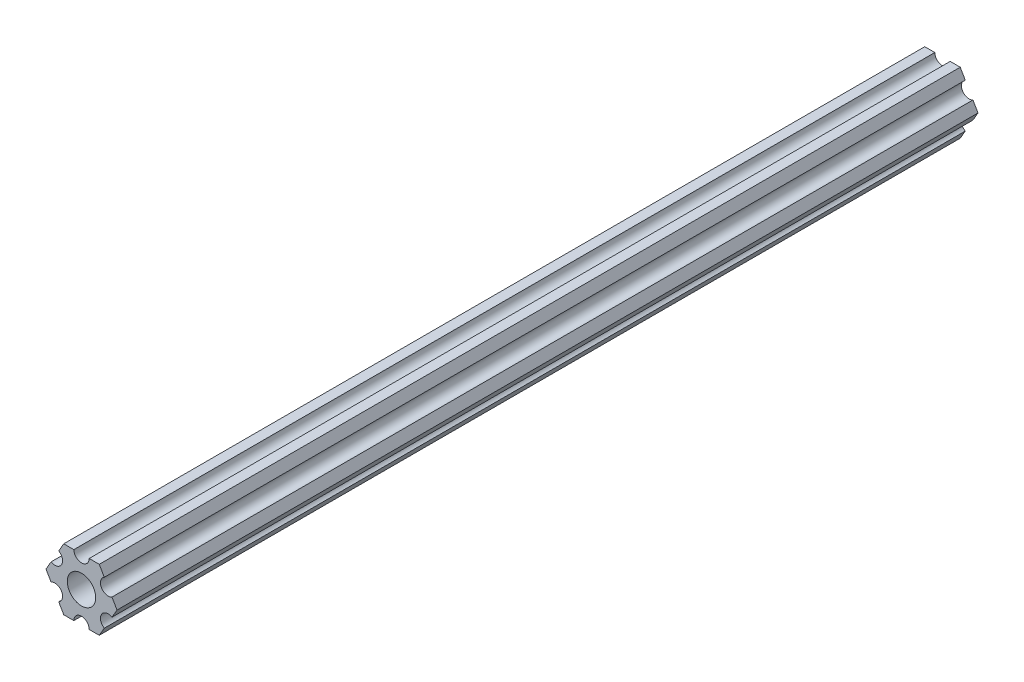
ISO-10303-21;
HEADER;
FILE_DESCRIPTION(('STEP AP214'),'2;1');
FILE_NAME('part.step','',(''),(''),'','','');
FILE_SCHEMA(('AUTOMOTIVE_DESIGN { 1 0 10303 214 1 1 1 1 }'));
ENDSEC;
DATA;
#1=APPLICATION_CONTEXT('core data for automotive mechanical design processes');
#2=APPLICATION_PROTOCOL_DEFINITION('international standard','automotive_design',2000,#1);
#3=PRODUCT_CONTEXT('',#1,'mechanical');
#4=PRODUCT('Part','Part','',(#3));
#5=PRODUCT_RELATED_PRODUCT_CATEGORY('part','',(#4));
#6=PRODUCT_DEFINITION_FORMATION('','',#4);
#7=PRODUCT_DEFINITION_CONTEXT('part definition',#1,'design');
#8=PRODUCT_DEFINITION('design','',#6,#7);
#9=PRODUCT_DEFINITION_SHAPE('','',#8);
#10=(LENGTH_UNIT() NAMED_UNIT(*) SI_UNIT(.MILLI.,.METRE.));
#11=(NAMED_UNIT(*) PLANE_ANGLE_UNIT() SI_UNIT($,.RADIAN.));
#12=(NAMED_UNIT(*) SI_UNIT($,.STERADIAN.) SOLID_ANGLE_UNIT());
#13=UNCERTAINTY_MEASURE_WITH_UNIT(LENGTH_MEASURE(1.E-05),#10,'distance_accuracy_value','');
#14=(GEOMETRIC_REPRESENTATION_CONTEXT(3) GLOBAL_UNCERTAINTY_ASSIGNED_CONTEXT((#13)) GLOBAL_UNIT_ASSIGNED_CONTEXT((#10,
#11,#12)) REPRESENTATION_CONTEXT('',''));
#15=CARTESIAN_POINT('',(0.,0.,0.));
#16=DIRECTION('',(0.,0.,1.));
#17=DIRECTION('',(1.,0.,0.));
#18=AXIS2_PLACEMENT_3D('',#15,#16,#17);
#19=CARTESIAN_POINT('',(0.,0.,-12.7));
#20=DIRECTION('',(0.,0.,-1.));
#21=DIRECTION('',(0.,-1.,0.));
#22=AXIS2_PLACEMENT_3D('',#19,#20,#21);
#23=PLANE('',#22);
#24=CARTESIAN_POINT('',(158.928629669335,29.0087650860692,-12.7));
#25=DIRECTION('',(0.,0.,-1.));
#26=DIRECTION('',(-1.,0.,0.));
#27=AXIS2_PLACEMENT_3D('',#24,#25,#26);
#28=CIRCLE('',#27,2.9337);
#29=CARTESIAN_POINT('',(155.994929669335,29.0087650860692,-12.7));
#30=VERTEX_POINT('',#29);
#31=EDGE_CURVE('E402',#30,#30,#28,.T.);
#32=ORIENTED_EDGE('',*,*,#31,.T.);
#33=EDGE_LOOP('',(#32));
#34=FACE_BOUND('',#33,.T.);
#35=DIRECTION('',(0.499999947533935,0.866025434075734,0.));
#36=VECTOR('',#35,1.);
#37=CARTESIAN_POINT('',(162.594804263388,22.6587653081755,-12.7));
#38=LINE('',#37,#36);
#39=CARTESIAN_POINT('',(162.594804263388,22.6587653081755,-12.7));
#40=VERTEX_POINT('',#39);
#41=CARTESIAN_POINT('',(163.634141259006,24.4589500426334,-12.7));
#42=VERTEX_POINT('',#41);
#43=EDGE_CURVE('E11',#40,#42,#38,.T.);
#44=ORIENTED_EDGE('',*,*,#43,.T.);
#45=CARTESIAN_POINT('',(164.427891175716,25.8337654192285,-12.7));
#46=DIRECTION('',(0.,0.,-1.));
#47=DIRECTION('',(-1.,0.,0.));
#48=AXIS2_PLACEMENT_3D('',#45,#46,#47);
#49=CIRCLE('',#48,1.5875);
#50=CARTESIAN_POINT('',(165.221641092426,27.2085807958237,-12.7));
#51=VERTEX_POINT('',#50);
#52=EDGE_CURVE('E37',#42,#51,#49,.T.);
#53=ORIENTED_EDGE('',*,*,#52,.T.);
#54=DIRECTION('',(0.499999947533942,0.86602543407573,0.));
#55=VECTOR('',#54,1.);
#56=CARTESIAN_POINT('',(165.221641092426,27.2085807958237,-12.7));
#57=LINE('',#56,#55);
#58=CARTESIAN_POINT('',(166.260978088043,29.0087655302817,-12.7));
#59=VERTEX_POINT('',#58);
#60=EDGE_CURVE('E196',#51,#59,#57,.T.);
#61=ORIENTED_EDGE('',*,*,#60,.T.);
#62=DIRECTION('',(-0.500000052466056,0.866025373493145,0.));
#63=VECTOR('',#62,1.);
#64=CARTESIAN_POINT('',(166.260978088043,29.0087655302817,-12.7));
#65=LINE('',#64,#63);
#66=CARTESIAN_POINT('',(165.221640874306,30.8089501388082,-12.7));
#67=VERTEX_POINT('',#66);
#68=EDGE_CURVE('E215',#59,#67,#65,.T.);
#69=ORIENTED_EDGE('',*,*,#68,.T.);
#70=CARTESIAN_POINT('',(164.427890791016,32.1837654192285,-12.7));
#71=DIRECTION('',(0.,0.,-1.));
#72=DIRECTION('',(-1.,0.,0.));
#73=AXIS2_PLACEMENT_3D('',#70,#71,#72);
#74=CIRCLE('',#73,1.5875);
#75=CARTESIAN_POINT('',(163.634140707727,33.5585806996489,-12.7));
#76=VERTEX_POINT('',#75);
#77=EDGE_CURVE('E417',#67,#76,#74,.T.);
#78=ORIENTED_EDGE('',*,*,#77,.T.);
#79=DIRECTION('',(-0.500000052466048,0.86602537349315,0.));
#80=VECTOR('',#79,1.);
#81=CARTESIAN_POINT('',(163.634140707727,33.5585806996489,-12.7));
#82=LINE('',#81,#80);
#83=CARTESIAN_POINT('',(162.59480349399,35.3587653081754,-12.7));
#84=VERTEX_POINT('',#83);
#85=EDGE_CURVE('E153',#76,#84,#82,.T.);
#86=ORIENTED_EDGE('',*,*,#85,.T.);
#87=DIRECTION('',(-1.,-6.05825863129189E-08,0.));
#88=VECTOR('',#87,1.);
#89=CARTESIAN_POINT('',(162.59480349399,35.3587653081754,-12.7));
#90=LINE('',#89,#88);
#91=CARTESIAN_POINT('',(160.516129284635,35.358765182244,-12.7));
#92=VERTEX_POINT('',#91);
#93=EDGE_CURVE('E155',#84,#92,#90,.T.);
#94=ORIENTED_EDGE('',*,*,#93,.T.);
#95=CARTESIAN_POINT('',(158.928629284635,35.3587650860692,-12.7));
#96=DIRECTION('',(0.,0.,-1.));
#97=DIRECTION('',(-1.,0.,0.));
#98=AXIS2_PLACEMENT_3D('',#95,#96,#97);
#99=CIRCLE('',#98,1.5875);
#100=CARTESIAN_POINT('',(157.341129284636,35.3587650860692,-12.7));
#101=VERTEX_POINT('',#100);
#102=EDGE_CURVE('E232',#92,#101,#99,.T.);
#103=ORIENTED_EDGE('',*,*,#102,.T.);
#104=DIRECTION('',(-1.,-6.05825963273181E-08,0.));
#105=VECTOR('',#104,1.);
#106=CARTESIAN_POINT('',(157.341129284636,35.3587649898944,-12.7));
#107=LINE('',#106,#105);
#108=CARTESIAN_POINT('',(155.262455075281,35.3587648639629,-12.7));
#109=VERTEX_POINT('',#108);
#110=EDGE_CURVE('E237',#101,#109,#107,.T.);
#111=ORIENTED_EDGE('',*,*,#110,.T.);
#112=DIRECTION('',(-0.499999947533936,-0.866025434075733,0.));
#113=VECTOR('',#112,1.);
#114=CARTESIAN_POINT('',(155.262455075281,35.3587648639629,-12.7));
#115=LINE('',#114,#113);
#116=CARTESIAN_POINT('',(154.223118079664,33.5585801295051,-12.7));
#117=VERTEX_POINT('',#116);
#118=EDGE_CURVE('E250',#109,#117,#115,.T.);
#119=ORIENTED_EDGE('',*,*,#118,.T.);
#120=CARTESIAN_POINT('',(153.429368162954,32.1837647529099,-12.7));
#121=DIRECTION('',(0.,0.,-1.));
#122=DIRECTION('',(-1.,0.,0.));
#123=AXIS2_PLACEMENT_3D('',#120,#121,#122);
#124=CIRCLE('',#123,1.5875);
#125=CARTESIAN_POINT('',(152.635618246244,30.8089493763146,-12.7));
#126=VERTEX_POINT('',#125);
#127=EDGE_CURVE('E187',#117,#126,#124,.T.);
#128=ORIENTED_EDGE('',*,*,#127,.T.);
#129=DIRECTION('',(-0.499999947533944,-0.866025434075728,0.));
#130=VECTOR('',#129,1.);
#131=CARTESIAN_POINT('',(152.635618246244,30.8089493763146,-12.7));
#132=LINE('',#131,#130);
#133=CARTESIAN_POINT('',(151.596281250627,29.0087646418567,-12.7));
#134=VERTEX_POINT('',#133);
#135=EDGE_CURVE('E260',#126,#134,#132,.T.);
#136=ORIENTED_EDGE('',*,*,#135,.T.);
#137=DIRECTION('',(0.50000005246604,-0.866025373493155,0.));
#138=VECTOR('',#137,1.);
#139=CARTESIAN_POINT('',(151.596281250627,29.0087646418567,-12.7));
#140=LINE('',#139,#138);
#141=CARTESIAN_POINT('',(152.635618464363,27.2085800333302,-12.7));
#142=VERTEX_POINT('',#141);
#143=EDGE_CURVE('E264',#134,#142,#140,.T.);
#144=ORIENTED_EDGE('',*,*,#143,.T.);
#145=CARTESIAN_POINT('',(153.429368547653,25.8337647529099,-12.7));
#146=DIRECTION('',(0.,0.,-1.));
#147=DIRECTION('',(-1.,0.,0.));
#148=AXIS2_PLACEMENT_3D('',#145,#146,#147);
#149=CIRCLE('',#148,1.5875);
#150=CARTESIAN_POINT('',(154.223118630943,24.4589494724895,-12.7));
#151=VERTEX_POINT('',#150);
#152=EDGE_CURVE('E219',#142,#151,#149,.T.);
#153=ORIENTED_EDGE('',*,*,#152,.T.);
#154=DIRECTION('',(0.500000052466047,-0.866025373493151,0.));
#155=VECTOR('',#154,1.);
#156=CARTESIAN_POINT('',(154.223118630943,24.4589494724895,-12.7));
#157=LINE('',#156,#155);
#158=CARTESIAN_POINT('',(155.26245584468,22.658764863963,-12.7));
#159=VERTEX_POINT('',#158);
#160=EDGE_CURVE('E157',#151,#159,#157,.T.);
#161=ORIENTED_EDGE('',*,*,#160,.T.);
#162=DIRECTION('',(1.,6.05825863129189E-08,0.));
#163=VECTOR('',#162,1.);
#164=CARTESIAN_POINT('',(155.26245584468,22.658764863963,-12.7));
#165=LINE('',#164,#163);
#166=CARTESIAN_POINT('',(157.341130054034,22.6587649898944,-12.7));
#167=VERTEX_POINT('',#166);
#168=EDGE_CURVE('E91',#159,#167,#165,.T.);
#169=ORIENTED_EDGE('',*,*,#168,.T.);
#170=CARTESIAN_POINT('',(158.928630054034,22.6587650860692,-12.7));
#171=DIRECTION('',(0.,0.,-1.));
#172=DIRECTION('',(-1.,0.,0.));
#173=AXIS2_PLACEMENT_3D('',#170,#171,#172);
#174=CIRCLE('',#173,1.5875);
#175=CARTESIAN_POINT('',(160.516130054034,22.658765182244,-12.7));
#176=VERTEX_POINT('',#175);
#177=EDGE_CURVE('E93',#167,#176,#174,.T.);
#178=ORIENTED_EDGE('',*,*,#177,.T.);
#179=DIRECTION('',(1.,6.05825712913108E-08,0.));
#180=VECTOR('',#179,1.);
#181=CARTESIAN_POINT('',(160.516130054034,22.658765182244,-12.7));
#182=LINE('',#181,#180);
#183=EDGE_CURVE('E77',#176,#40,#182,.T.);
#184=ORIENTED_EDGE('',*,*,#183,.T.);
#185=EDGE_LOOP('',(#44,#53,#61,#69,#78,#86,#94,#103,#111,#119,#128,#136,#144,#153,#161,#169,
#178,#184));
#186=FACE_BOUND('',#185,.T.);
#187=ADVANCED_FACE('F17',(#34,#186),#23,.F.);
#188=CARTESIAN_POINT('',(162.594804263388,22.6587653081755,0.));
#189=DIRECTION('',(-0.86602543407573,0.499999947533941,0.));
#190=DIRECTION('',(0.,0.,1.));
#191=AXIS2_PLACEMENT_3D('',#188,#189,#190);
#192=PLANE('',#191);
#193=DIRECTION('',(0.,0.,-1.));
#194=VECTOR('',#193,1.);
#195=CARTESIAN_POINT('',(163.634141259006,24.4589500426334,0.));
#196=LINE('',#195,#194);
#197=CARTESIAN_POINT('',(163.634141259006,24.4589500426334,-190.5));
#198=VERTEX_POINT('',#197);
#199=EDGE_CURVE('E20',#42,#198,#196,.T.);
#200=ORIENTED_EDGE('',*,*,#199,.F.);
#201=ORIENTED_EDGE('',*,*,#43,.F.);
#202=DIRECTION('',(0.,0.,-1.));
#203=VECTOR('',#202,1.);
#204=CARTESIAN_POINT('',(162.594804263388,22.6587653081755,0.));
#205=LINE('',#204,#203);
#206=CARTESIAN_POINT('',(162.594804263388,22.6587653081755,-190.5));
#207=VERTEX_POINT('',#206);
#208=EDGE_CURVE('E87',#40,#207,#205,.T.);
#209=ORIENTED_EDGE('',*,*,#208,.T.);
#210=DIRECTION('',(0.499999947533941,0.86602543407573,0.));
#211=VECTOR('',#210,1.);
#212=CARTESIAN_POINT('',(162.594804263388,22.6587653081755,-190.5));
#213=LINE('',#212,#211);
#214=EDGE_CURVE('E123',#207,#198,#213,.T.);
#215=ORIENTED_EDGE('',*,*,#214,.T.);
#216=EDGE_LOOP('',(#200,#201,#209,#215));
#217=FACE_BOUND('',#216,.T.);
#218=ADVANCED_FACE('F120',(#217),#192,.F.);
#219=CARTESIAN_POINT('',(160.516130054034,22.658765182244,0.));
#220=DIRECTION('',(-6.05825721258438E-08,1.,0.));
#221=DIRECTION('',(0.,0.,1.));
#222=AXIS2_PLACEMENT_3D('',#219,#220,#221);
#223=PLANE('',#222);
#224=ORIENTED_EDGE('',*,*,#208,.F.);
#225=ORIENTED_EDGE('',*,*,#183,.F.);
#226=DIRECTION('',(0.,0.,-1.));
#227=VECTOR('',#226,1.);
#228=CARTESIAN_POINT('',(160.516130054034,22.658765182244,0.));
#229=LINE('',#228,#227);
#230=CARTESIAN_POINT('',(160.516130054034,22.658765182244,-190.5));
#231=VERTEX_POINT('',#230);
#232=EDGE_CURVE('E82',#176,#231,#229,.T.);
#233=ORIENTED_EDGE('',*,*,#232,.T.);
#234=DIRECTION('',(1.,6.05825721258438E-08,0.));
#235=VECTOR('',#234,1.);
#236=CARTESIAN_POINT('',(160.516130054034,22.658765182244,-190.5));
#237=LINE('',#236,#235);
#238=EDGE_CURVE('E130',#231,#207,#237,.T.);
#239=ORIENTED_EDGE('',*,*,#238,.T.);
#240=EDGE_LOOP('',(#224,#225,#233,#239));
#241=FACE_BOUND('',#240,.T.);
#242=ADVANCED_FACE('F79',(#241),#223,.F.);
#243=CARTESIAN_POINT('',(158.928630054034,22.6587650860692,0.));
#244=DIRECTION('',(0.,0.,-1.));
#245=DIRECTION('',(-1.,0.,0.));
#246=AXIS2_PLACEMENT_3D('',#243,#244,#245);
#247=CYLINDRICAL_SURFACE('',#246,1.5875);
#248=ORIENTED_EDGE('',*,*,#232,.F.);
#249=ORIENTED_EDGE('',*,*,#177,.F.);
#250=DIRECTION('',(0.,0.,-1.));
#251=VECTOR('',#250,1.);
#252=CARTESIAN_POINT('',(157.341130054034,22.6587649898944,0.));
#253=LINE('',#252,#251);
#254=CARTESIAN_POINT('',(157.341130054034,22.6587649898944,-190.5));
#255=VERTEX_POINT('',#254);
#256=EDGE_CURVE('E108',#167,#255,#253,.T.);
#257=ORIENTED_EDGE('',*,*,#256,.T.);
#258=CARTESIAN_POINT('',(158.928630054034,22.6587650860692,-190.5));
#259=DIRECTION('',(0.,0.,-1.));
#260=DIRECTION('',(1.,0.,0.));
#261=AXIS2_PLACEMENT_3D('',#258,#259,#260);
#262=CIRCLE('',#261,1.5875);
#263=EDGE_CURVE('E101',#255,#231,#262,.T.);
#264=ORIENTED_EDGE('',*,*,#263,.T.);
#265=EDGE_LOOP('',(#248,#249,#257,#264));
#266=FACE_BOUND('',#265,.T.);
#267=ADVANCED_FACE('F97',(#266),#247,.F.);
#268=CARTESIAN_POINT('',(155.26245584468,22.658764863963,0.));
#269=DIRECTION('',(-6.05825854783851E-08,1.,0.));
#270=DIRECTION('',(0.,0.,1.));
#271=AXIS2_PLACEMENT_3D('',#268,#269,#270);
#272=PLANE('',#271);
#273=ORIENTED_EDGE('',*,*,#256,.F.);
#274=ORIENTED_EDGE('',*,*,#168,.F.);
#275=DIRECTION('',(0.,0.,-1.));
#276=VECTOR('',#275,1.);
#277=CARTESIAN_POINT('',(155.26245584468,22.658764863963,0.));
#278=LINE('',#277,#276);
#279=CARTESIAN_POINT('',(155.26245584468,22.658764863963,-190.5));
#280=VERTEX_POINT('',#279);
#281=EDGE_CURVE('E167',#159,#280,#278,.T.);
#282=ORIENTED_EDGE('',*,*,#281,.T.);
#283=DIRECTION('',(1.,6.05825854783851E-08,0.));
#284=VECTOR('',#283,1.);
#285=CARTESIAN_POINT('',(155.26245584468,22.658764863963,-190.5));
#286=LINE('',#285,#284);
#287=EDGE_CURVE('E156',#280,#255,#286,.T.);
#288=ORIENTED_EDGE('',*,*,#287,.T.);
#289=EDGE_LOOP('',(#273,#274,#282,#288));
#290=FACE_BOUND('',#289,.T.);
#291=ADVANCED_FACE('F465',(#290),#272,.F.);
#292=CARTESIAN_POINT('',(154.223118630943,24.4589494724895,0.));
#293=DIRECTION('',(0.866025373493152,0.500000052466045,0.));
#294=DIRECTION('',(0.,0.,-1.));
#295=AXIS2_PLACEMENT_3D('',#292,#293,#294);
#296=PLANE('',#295);
#297=ORIENTED_EDGE('',*,*,#281,.F.);
#298=ORIENTED_EDGE('',*,*,#160,.F.);
#299=DIRECTION('',(0.,0.,-1.));
#300=VECTOR('',#299,1.);
#301=CARTESIAN_POINT('',(154.223118630943,24.4589494724895,0.));
#302=LINE('',#301,#300);
#303=CARTESIAN_POINT('',(154.223118630943,24.4589494724895,-190.5));
#304=VERTEX_POINT('',#303);
#305=EDGE_CURVE('E267',#151,#304,#302,.T.);
#306=ORIENTED_EDGE('',*,*,#305,.T.);
#307=DIRECTION('',(0.500000052466045,-0.866025373493152,0.));
#308=VECTOR('',#307,1.);
#309=CARTESIAN_POINT('',(154.223118630943,24.4589494724895,-190.5));
#310=LINE('',#309,#308);
#311=EDGE_CURVE('E162',#304,#280,#310,.T.);
#312=ORIENTED_EDGE('',*,*,#311,.T.);
#313=EDGE_LOOP('',(#297,#298,#306,#312));
#314=FACE_BOUND('',#313,.T.);
#315=ADVANCED_FACE('F286',(#314),#296,.F.);
#316=CARTESIAN_POINT('',(153.429368547653,25.8337647529099,0.));
#317=DIRECTION('',(0.,0.,-1.));
#318=DIRECTION('',(-1.,0.,0.));
#319=AXIS2_PLACEMENT_3D('',#316,#317,#318);
#320=CYLINDRICAL_SURFACE('',#319,1.5875);
#321=ORIENTED_EDGE('',*,*,#305,.F.);
#322=ORIENTED_EDGE('',*,*,#152,.F.);
#323=DIRECTION('',(0.,0.,-1.));
#324=VECTOR('',#323,1.);
#325=CARTESIAN_POINT('',(152.635618464363,27.2085800333302,0.));
#326=LINE('',#325,#324);
#327=CARTESIAN_POINT('',(152.635618464363,27.2085800333302,-190.5));
#328=VERTEX_POINT('',#327);
#329=EDGE_CURVE('E261',#142,#328,#326,.T.);
#330=ORIENTED_EDGE('',*,*,#329,.T.);
#331=CARTESIAN_POINT('',(153.429368547653,25.8337647529099,-190.5));
#332=DIRECTION('',(0.,0.,-1.));
#333=DIRECTION('',(1.,0.,0.));
#334=AXIS2_PLACEMENT_3D('',#331,#332,#333);
#335=CIRCLE('',#334,1.5875);
#336=EDGE_CURVE('E170',#328,#304,#335,.T.);
#337=ORIENTED_EDGE('',*,*,#336,.T.);
#338=EDGE_LOOP('',(#321,#322,#330,#337));
#339=FACE_BOUND('',#338,.T.);
#340=ADVANCED_FACE('F278',(#339),#320,.F.);
#341=CARTESIAN_POINT('',(151.596281250627,29.0087646418567,0.));
#342=DIRECTION('',(0.866025373493151,0.500000052466045,0.));
#343=DIRECTION('',(0.,0.,-1.));
#344=AXIS2_PLACEMENT_3D('',#341,#342,#343);
#345=PLANE('',#344);
#346=ORIENTED_EDGE('',*,*,#329,.F.);
#347=ORIENTED_EDGE('',*,*,#143,.F.);
#348=DIRECTION('',(0.,0.,-1.));
#349=VECTOR('',#348,1.);
#350=CARTESIAN_POINT('',(151.596281250627,29.0087646418567,0.));
#351=LINE('',#350,#349);
#352=CARTESIAN_POINT('',(151.596281250627,29.0087646418567,-190.5));
#353=VERTEX_POINT('',#352);
#354=EDGE_CURVE('E195',#134,#353,#351,.T.);
#355=ORIENTED_EDGE('',*,*,#354,.T.);
#356=DIRECTION('',(0.500000052466045,-0.866025373493151,0.));
#357=VECTOR('',#356,1.);
#358=CARTESIAN_POINT('',(151.596281250627,29.0087646418567,-190.5));
#359=LINE('',#358,#357);
#360=EDGE_CURVE('E171',#353,#328,#359,.T.);
#361=ORIENTED_EDGE('',*,*,#360,.T.);
#362=EDGE_LOOP('',(#346,#347,#355,#361));
#363=FACE_BOUND('',#362,.T.);
#364=ADVANCED_FACE('F469',(#363),#345,.F.);
#365=CARTESIAN_POINT('',(152.635618246244,30.8089493763146,0.));
#366=DIRECTION('',(0.866025434075724,-0.499999947533952,0.));
#367=DIRECTION('',(0.,0.,-1.));
#368=AXIS2_PLACEMENT_3D('',#365,#366,#367);
#369=PLANE('',#368);
#370=ORIENTED_EDGE('',*,*,#354,.F.);
#371=ORIENTED_EDGE('',*,*,#135,.F.);
#372=DIRECTION('',(0.,0.,-1.));
#373=VECTOR('',#372,1.);
#374=CARTESIAN_POINT('',(152.635618246244,30.8089493763146,0.));
#375=LINE('',#374,#373);
#376=CARTESIAN_POINT('',(152.635618246244,30.8089493763146,-190.5));
#377=VERTEX_POINT('',#376);
#378=EDGE_CURVE('E193',#126,#377,#375,.T.);
#379=ORIENTED_EDGE('',*,*,#378,.T.);
#380=DIRECTION('',(-0.499999947533951,-0.866025434075724,0.));
#381=VECTOR('',#380,1.);
#382=CARTESIAN_POINT('',(152.635618246244,30.8089493763146,-190.5));
#383=LINE('',#382,#381);
#384=EDGE_CURVE('E148',#377,#353,#383,.T.);
#385=ORIENTED_EDGE('',*,*,#384,.T.);
#386=EDGE_LOOP('',(#370,#371,#379,#385));
#387=FACE_BOUND('',#386,.T.);
#388=ADVANCED_FACE('F466',(#387),#369,.F.);
#389=CARTESIAN_POINT('',(153.429368162954,32.1837647529099,0.));
#390=DIRECTION('',(0.,0.,-1.));
#391=DIRECTION('',(-1.,0.,0.));
#392=AXIS2_PLACEMENT_3D('',#389,#390,#391);
#393=CYLINDRICAL_SURFACE('',#392,1.5875);
#394=ORIENTED_EDGE('',*,*,#378,.F.);
#395=ORIENTED_EDGE('',*,*,#127,.F.);
#396=DIRECTION('',(0.,0.,-1.));
#397=VECTOR('',#396,1.);
#398=CARTESIAN_POINT('',(154.223118079664,33.5585801295051,0.));
#399=LINE('',#398,#397);
#400=CARTESIAN_POINT('',(154.223118079664,33.5585801295051,-190.5));
#401=VERTEX_POINT('',#400);
#402=EDGE_CURVE('E242',#117,#401,#399,.T.);
#403=ORIENTED_EDGE('',*,*,#402,.T.);
#404=CARTESIAN_POINT('',(153.429368162954,32.1837647529099,-190.5));
#405=DIRECTION('',(0.,0.,-1.));
#406=DIRECTION('',(1.,0.,0.));
#407=AXIS2_PLACEMENT_3D('',#404,#405,#406);
#408=CIRCLE('',#407,1.5875);
#409=EDGE_CURVE('E175',#401,#377,#408,.T.);
#410=ORIENTED_EDGE('',*,*,#409,.T.);
#411=EDGE_LOOP('',(#394,#395,#403,#410));
#412=FACE_BOUND('',#411,.T.);
#413=ADVANCED_FACE('F467',(#412),#393,.F.);
#414=CARTESIAN_POINT('',(155.262455075281,35.3587648639629,0.));
#415=DIRECTION('',(0.866025434075729,-0.499999947533942,0.));
#416=DIRECTION('',(0.,0.,-1.));
#417=AXIS2_PLACEMENT_3D('',#414,#415,#416);
#418=PLANE('',#417);
#419=ORIENTED_EDGE('',*,*,#402,.F.);
#420=ORIENTED_EDGE('',*,*,#118,.F.);
#421=DIRECTION('',(0.,0.,-1.));
#422=VECTOR('',#421,1.);
#423=CARTESIAN_POINT('',(155.262455075281,35.3587648639629,0.));
#424=LINE('',#423,#422);
#425=CARTESIAN_POINT('',(155.262455075281,35.3587648639629,-190.5));
#426=VERTEX_POINT('',#425);
#427=EDGE_CURVE('E236',#109,#426,#424,.T.);
#428=ORIENTED_EDGE('',*,*,#427,.T.);
#429=DIRECTION('',(-0.499999947533943,-0.866025434075729,0.));
#430=VECTOR('',#429,1.);
#431=CARTESIAN_POINT('',(155.262455075281,35.3587648639629,-190.5));
#432=LINE('',#431,#430);
#433=EDGE_CURVE('E177',#426,#401,#432,.T.);
#434=ORIENTED_EDGE('',*,*,#433,.T.);
#435=EDGE_LOOP('',(#419,#420,#428,#434));
#436=FACE_BOUND('',#435,.T.);
#437=ADVANCED_FACE('F388',(#436),#418,.F.);
#438=CARTESIAN_POINT('',(157.341129284636,35.3587649898944,0.));
#439=DIRECTION('',(6.05825963273174E-08,-1.,0.));
#440=DIRECTION('',(0.,0.,-1.));
#441=AXIS2_PLACEMENT_3D('',#438,#439,#440);
#442=PLANE('',#441);
#443=ORIENTED_EDGE('',*,*,#427,.F.);
#444=ORIENTED_EDGE('',*,*,#110,.F.);
#445=DIRECTION('',(0.,0.,-1.));
#446=VECTOR('',#445,1.);
#447=CARTESIAN_POINT('',(157.341129284636,35.3587649898944,0.));
#448=LINE('',#447,#446);
#449=CARTESIAN_POINT('',(157.341129284636,35.3587649898944,-190.5));
#450=VERTEX_POINT('',#449);
#451=EDGE_CURVE('E230',#101,#450,#448,.T.);
#452=ORIENTED_EDGE('',*,*,#451,.T.);
#453=DIRECTION('',(-1.,-6.05825963273174E-08,0.));
#454=VECTOR('',#453,1.);
#455=CARTESIAN_POINT('',(157.341129284636,35.3587649898944,-190.5));
#456=LINE('',#455,#454);
#457=EDGE_CURVE('E183',#450,#426,#456,.T.);
#458=ORIENTED_EDGE('',*,*,#457,.T.);
#459=EDGE_LOOP('',(#443,#444,#452,#458));
#460=FACE_BOUND('',#459,.T.);
#461=ADVANCED_FACE('F378',(#460),#442,.F.);
#462=CARTESIAN_POINT('',(158.928629284635,35.3587650860692,0.));
#463=DIRECTION('',(0.,0.,-1.));
#464=DIRECTION('',(-1.,0.,0.));
#465=AXIS2_PLACEMENT_3D('',#462,#463,#464);
#466=CYLINDRICAL_SURFACE('',#465,1.5875);
#467=ORIENTED_EDGE('',*,*,#451,.F.);
#468=ORIENTED_EDGE('',*,*,#102,.F.);
#469=DIRECTION('',(0.,0.,-1.));
#470=VECTOR('',#469,1.);
#471=CARTESIAN_POINT('',(160.516129284635,35.358765182244,0.));
#472=LINE('',#471,#470);
#473=CARTESIAN_POINT('',(160.516129284635,35.358765182244,-190.5));
#474=VERTEX_POINT('',#473);
#475=EDGE_CURVE('E146',#92,#474,#472,.T.);
#476=ORIENTED_EDGE('',*,*,#475,.T.);
#477=CARTESIAN_POINT('',(158.928629284635,35.3587650860692,-190.5));
#478=DIRECTION('',(0.,0.,-1.));
#479=DIRECTION('',(1.,0.,0.));
#480=AXIS2_PLACEMENT_3D('',#477,#478,#479);
#481=CIRCLE('',#480,1.5875);
#482=EDGE_CURVE('E190',#474,#450,#481,.T.);
#483=ORIENTED_EDGE('',*,*,#482,.T.);
#484=EDGE_LOOP('',(#467,#468,#476,#483));
#485=FACE_BOUND('',#484,.T.);
#486=ADVANCED_FACE('F385',(#485),#466,.F.);
#487=CARTESIAN_POINT('',(162.59480349399,35.3587653081754,0.));
#488=DIRECTION('',(6.05825850611185E-08,-1.,0.));
#489=DIRECTION('',(0.,0.,-1.));
#490=AXIS2_PLACEMENT_3D('',#487,#488,#489);
#491=PLANE('',#490);
#492=ORIENTED_EDGE('',*,*,#475,.F.);
#493=ORIENTED_EDGE('',*,*,#93,.F.);
#494=DIRECTION('',(0.,0.,-1.));
#495=VECTOR('',#494,1.);
#496=CARTESIAN_POINT('',(162.59480349399,35.3587653081754,0.));
#497=LINE('',#496,#495);
#498=CARTESIAN_POINT('',(162.59480349399,35.3587653081754,-190.5));
#499=VERTEX_POINT('',#498);
#500=EDGE_CURVE('E216',#84,#499,#497,.T.);
#501=ORIENTED_EDGE('',*,*,#500,.T.);
#502=DIRECTION('',(-1.,-6.05825850611185E-08,0.));
#503=VECTOR('',#502,1.);
#504=CARTESIAN_POINT('',(162.59480349399,35.3587653081754,-190.5));
#505=LINE('',#504,#503);
#506=EDGE_CURVE('E201',#499,#474,#505,.T.);
#507=ORIENTED_EDGE('',*,*,#506,.T.);
#508=EDGE_LOOP('',(#492,#493,#501,#507));
#509=FACE_BOUND('',#508,.T.);
#510=ADVANCED_FACE('F485',(#509),#491,.F.);
#511=CARTESIAN_POINT('',(163.634140707727,33.5585806996489,0.));
#512=DIRECTION('',(-0.866025373493151,-0.500000052466046,0.));
#513=DIRECTION('',(-0.500000052466046,0.866025373493151,0.));
#514=AXIS2_PLACEMENT_3D('',#511,#512,#513);
#515=PLANE('',#514);
#516=ORIENTED_EDGE('',*,*,#500,.F.);
#517=ORIENTED_EDGE('',*,*,#85,.F.);
#518=DIRECTION('',(0.,0.,-1.));
#519=VECTOR('',#518,1.);
#520=CARTESIAN_POINT('',(163.634140707727,33.5585806996489,0.));
#521=LINE('',#520,#519);
#522=CARTESIAN_POINT('',(163.634140707727,33.5585806996489,-190.5));
#523=VERTEX_POINT('',#522);
#524=EDGE_CURVE('E142',#76,#523,#521,.T.);
#525=ORIENTED_EDGE('',*,*,#524,.T.);
#526=DIRECTION('',(-0.500000052466046,0.866025373493151,0.));
#527=VECTOR('',#526,1.);
#528=CARTESIAN_POINT('',(163.634140707727,33.5585806996489,-190.5));
#529=LINE('',#528,#527);
#530=EDGE_CURVE('E210',#523,#499,#529,.T.);
#531=ORIENTED_EDGE('',*,*,#530,.T.);
#532=EDGE_LOOP('',(#516,#517,#525,#531));
#533=FACE_BOUND('',#532,.T.);
#534=ADVANCED_FACE('F484',(#533),#515,.F.);
#535=CARTESIAN_POINT('',(166.260978088043,29.0087655302817,0.));
#536=DIRECTION('',(-0.866025373493146,-0.500000052466055,0.));
#537=DIRECTION('',(-0.500000052466055,0.866025373493146,0.));
#538=AXIS2_PLACEMENT_3D('',#535,#536,#537);
#539=PLANE('',#538);
#540=DIRECTION('',(0.,0.,-1.));
#541=VECTOR('',#540,1.);
#542=CARTESIAN_POINT('',(165.221640874306,30.8089501388082,0.));
#543=LINE('',#542,#541);
#544=CARTESIAN_POINT('',(165.221640874306,30.8089501388082,-190.5));
#545=VERTEX_POINT('',#544);
#546=EDGE_CURVE('E208',#67,#545,#543,.T.);
#547=ORIENTED_EDGE('',*,*,#546,.F.);
#548=ORIENTED_EDGE('',*,*,#68,.F.);
#549=DIRECTION('',(0.,0.,-1.));
#550=VECTOR('',#549,1.);
#551=CARTESIAN_POINT('',(166.260978088043,29.0087655302817,0.));
#552=LINE('',#551,#550);
#553=CARTESIAN_POINT('',(166.260978088043,29.0087655302817,-190.5));
#554=VERTEX_POINT('',#553);
#555=EDGE_CURVE('E192',#59,#554,#552,.T.);
#556=ORIENTED_EDGE('',*,*,#555,.T.);
#557=DIRECTION('',(-0.500000052466055,0.866025373493145,0.));
#558=VECTOR('',#557,1.);
#559=CARTESIAN_POINT('',(166.260978088043,29.0087655302817,-190.5));
#560=LINE('',#559,#558);
#561=EDGE_CURVE('E200',#554,#545,#560,.T.);
#562=ORIENTED_EDGE('',*,*,#561,.T.);
#563=EDGE_LOOP('',(#547,#548,#556,#562));
#564=FACE_BOUND('',#563,.T.);
#565=ADVANCED_FACE('F487',(#564),#539,.F.);
#566=CARTESIAN_POINT('',(165.221641092426,27.2085807958237,0.));
#567=DIRECTION('',(-0.866025434075728,0.499999947533945,0.));
#568=DIRECTION('',(0.,0.,1.));
#569=AXIS2_PLACEMENT_3D('',#566,#567,#568);
#570=PLANE('',#569);
#571=ORIENTED_EDGE('',*,*,#555,.F.);
#572=ORIENTED_EDGE('',*,*,#60,.F.);
#573=DIRECTION('',(0.,0.,-1.));
#574=VECTOR('',#573,1.);
#575=CARTESIAN_POINT('',(165.221641092426,27.2085807958237,0.));
#576=LINE('',#575,#574);
#577=CARTESIAN_POINT('',(165.221641092426,27.2085807958237,-190.5));
#578=VERTEX_POINT('',#577);
#579=EDGE_CURVE('E415',#51,#578,#576,.T.);
#580=ORIENTED_EDGE('',*,*,#579,.T.);
#581=DIRECTION('',(0.499999947533945,0.866025434075728,0.));
#582=VECTOR('',#581,1.);
#583=CARTESIAN_POINT('',(165.221641092426,27.2085807958237,-190.5));
#584=LINE('',#583,#582);
#585=EDGE_CURVE('E136',#578,#554,#584,.T.);
#586=ORIENTED_EDGE('',*,*,#585,.T.);
#587=EDGE_LOOP('',(#571,#572,#580,#586));
#588=FACE_BOUND('',#587,.T.);
#589=ADVANCED_FACE('F494',(#588),#570,.F.);
#590=CARTESIAN_POINT('',(164.427890791016,32.1837654192285,-190.5));
#591=DIRECTION('',(0.,0.,1.));
#592=DIRECTION('',(1.,0.,0.));
#593=AXIS2_PLACEMENT_3D('',#590,#591,#592);
#594=PLANE('',#593);
#595=CARTESIAN_POINT('',(158.928629669335,29.0087650860692,-190.5));
#596=DIRECTION('',(0.,0.,1.));
#597=DIRECTION('',(1.,0.,0.));
#598=AXIS2_PLACEMENT_3D('',#595,#596,#597);
#599=CIRCLE('',#598,2.9337);
#600=CARTESIAN_POINT('',(161.862329669335,29.0087650860692,-190.5));
#601=VERTEX_POINT('',#600);
#602=EDGE_CURVE('E399',#601,#601,#599,.T.);
#603=ORIENTED_EDGE('',*,*,#602,.T.);
#604=EDGE_LOOP('',(#603));
#605=FACE_BOUND('',#604,.T.);
#606=ORIENTED_EDGE('',*,*,#585,.F.);
#607=CARTESIAN_POINT('',(164.427891175716,25.8337654192285,-190.5));
#608=DIRECTION('',(0.,0.,-1.));
#609=DIRECTION('',(1.,0.,0.));
#610=AXIS2_PLACEMENT_3D('',#607,#608,#609);
#611=CIRCLE('',#610,1.5875);
#612=EDGE_CURVE('E133',#198,#578,#611,.T.);
#613=ORIENTED_EDGE('',*,*,#612,.F.);
#614=ORIENTED_EDGE('',*,*,#214,.F.);
#615=ORIENTED_EDGE('',*,*,#238,.F.);
#616=ORIENTED_EDGE('',*,*,#263,.F.);
#617=ORIENTED_EDGE('',*,*,#287,.F.);
#618=ORIENTED_EDGE('',*,*,#311,.F.);
#619=ORIENTED_EDGE('',*,*,#336,.F.);
#620=ORIENTED_EDGE('',*,*,#360,.F.);
#621=ORIENTED_EDGE('',*,*,#384,.F.);
#622=ORIENTED_EDGE('',*,*,#409,.F.);
#623=ORIENTED_EDGE('',*,*,#433,.F.);
#624=ORIENTED_EDGE('',*,*,#457,.F.);
#625=ORIENTED_EDGE('',*,*,#482,.F.);
#626=ORIENTED_EDGE('',*,*,#506,.F.);
#627=ORIENTED_EDGE('',*,*,#530,.F.);
#628=CARTESIAN_POINT('',(164.427890791016,32.1837654192285,-190.5));
#629=DIRECTION('',(0.,0.,-1.));
#630=DIRECTION('',(1.,0.,0.));
#631=AXIS2_PLACEMENT_3D('',#628,#629,#630);
#632=CIRCLE('',#631,1.5875);
#633=EDGE_CURVE('E409',#545,#523,#632,.T.);
#634=ORIENTED_EDGE('',*,*,#633,.F.);
#635=ORIENTED_EDGE('',*,*,#561,.F.);
#636=EDGE_LOOP('',(#606,#613,#614,#615,#616,#617,#618,#619,#620,#621,#622,#623,#624,#625,#626,
#627,#634,#635));
#637=FACE_BOUND('',#636,.T.);
#638=ADVANCED_FACE('F135',(#605,#637),#594,.F.);
#639=CARTESIAN_POINT('',(164.427890791016,32.1837654192285,0.));
#640=DIRECTION('',(0.,0.,-1.));
#641=DIRECTION('',(-1.,0.,0.));
#642=AXIS2_PLACEMENT_3D('',#639,#640,#641);
#643=CYLINDRICAL_SURFACE('',#642,1.5875);
#644=ORIENTED_EDGE('',*,*,#77,.F.);
#645=ORIENTED_EDGE('',*,*,#546,.T.);
#646=ORIENTED_EDGE('',*,*,#633,.T.);
#647=ORIENTED_EDGE('',*,*,#524,.F.);
#648=EDGE_LOOP('',(#644,#645,#646,#647));
#649=FACE_BOUND('',#648,.T.);
#650=ADVANCED_FACE('F449',(#649),#643,.F.);
#651=CARTESIAN_POINT('',(164.427891175716,25.8337654192285,0.));
#652=DIRECTION('',(0.,0.,-1.));
#653=DIRECTION('',(-1.,0.,0.));
#654=AXIS2_PLACEMENT_3D('',#651,#652,#653);
#655=CYLINDRICAL_SURFACE('',#654,1.5875);
#656=ORIENTED_EDGE('',*,*,#52,.F.);
#657=ORIENTED_EDGE('',*,*,#199,.T.);
#658=ORIENTED_EDGE('',*,*,#612,.T.);
#659=ORIENTED_EDGE('',*,*,#579,.F.);
#660=EDGE_LOOP('',(#656,#657,#658,#659));
#661=FACE_BOUND('',#660,.T.);
#662=ADVANCED_FACE('F442',(#661),#655,.F.);
#663=CARTESIAN_POINT('',(158.928629669335,29.0087650860692,0.));
#664=DIRECTION('',(0.,0.,-1.));
#665=DIRECTION('',(-1.,0.,0.));
#666=AXIS2_PLACEMENT_3D('',#663,#664,#665);
#667=CYLINDRICAL_SURFACE('',#666,2.9337);
#668=ORIENTED_EDGE('',*,*,#602,.F.);
#669=EDGE_LOOP('',(#668));
#670=FACE_BOUND('',#669,.T.);
#671=ORIENTED_EDGE('',*,*,#31,.F.);
#672=EDGE_LOOP('',(#671));
#673=FACE_BOUND('',#672,.T.);
#674=ADVANCED_FACE('F438',(#670,#673),#667,.F.);
#675=CLOSED_SHELL('',(#187,#218,#242,#267,#291,#315,#340,#364,#388,#413,#437,#461,#486,#510,
#534,#565,#589,#638,#650,#662,#674));
#676=MANIFOLD_SOLID_BREP('B1',#675);
#677=ADVANCED_BREP_SHAPE_REPRESENTATION('',(#18,#676),#14);
#678=SHAPE_DEFINITION_REPRESENTATION(#9,#677);
ENDSEC;
END-ISO-10303-21;
